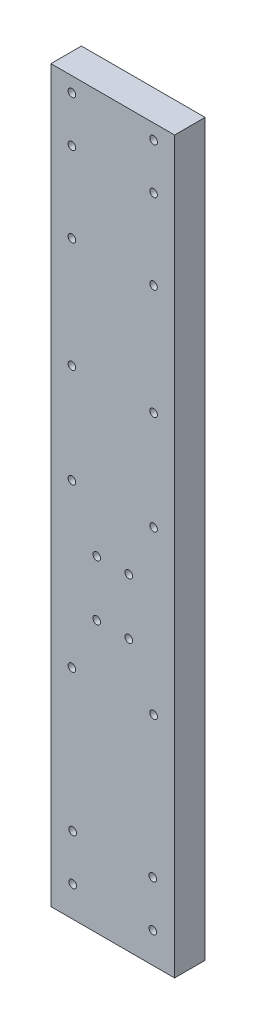
ISO-10303-21;
HEADER;
FILE_DESCRIPTION(('STEP AP214'),'2;1');
FILE_NAME('part.step','',(''),(''),'','','');
FILE_SCHEMA(('AUTOMOTIVE_DESIGN { 1 0 10303 214 1 1 1 1 }'));
ENDSEC;
DATA;
#1=APPLICATION_CONTEXT('core data for automotive mechanical design processes');
#2=APPLICATION_PROTOCOL_DEFINITION('international standard','automotive_design',2000,#1);
#3=PRODUCT_CONTEXT('',#1,'mechanical');
#4=PRODUCT('Part','Part','',(#3));
#5=PRODUCT_RELATED_PRODUCT_CATEGORY('part','',(#4));
#6=PRODUCT_DEFINITION_FORMATION('','',#4);
#7=PRODUCT_DEFINITION_CONTEXT('part definition',#1,'design');
#8=PRODUCT_DEFINITION('design','',#6,#7);
#9=PRODUCT_DEFINITION_SHAPE('','',#8);
#10=(LENGTH_UNIT() NAMED_UNIT(*) SI_UNIT(.MILLI.,.METRE.));
#11=(NAMED_UNIT(*) PLANE_ANGLE_UNIT() SI_UNIT($,.RADIAN.));
#12=(NAMED_UNIT(*) SI_UNIT($,.STERADIAN.) SOLID_ANGLE_UNIT());
#13=UNCERTAINTY_MEASURE_WITH_UNIT(LENGTH_MEASURE(1.E-05),#10,'distance_accuracy_value','');
#14=(GEOMETRIC_REPRESENTATION_CONTEXT(3) GLOBAL_UNCERTAINTY_ASSIGNED_CONTEXT((#13)) GLOBAL_UNIT_ASSIGNED_CONTEXT((#10,
#11,#12)) REPRESENTATION_CONTEXT('',''));
#15=CARTESIAN_POINT('',(0.,0.,0.));
#16=DIRECTION('',(0.,0.,1.));
#17=DIRECTION('',(1.,0.,0.));
#18=AXIS2_PLACEMENT_3D('',#15,#16,#17);
#19=CARTESIAN_POINT('',(0.,0.,4.));
#20=DIRECTION('',(0.,0.,-1.));
#21=DIRECTION('',(-1.,0.,0.));
#22=AXIS2_PLACEMENT_3D('',#19,#20,#21);
#23=PLANE('',#22);
#24=CARTESIAN_POINT('',(2.7500000000009,93.5614488310554,4.));
#25=DIRECTION('',(0.,0.,1.));
#26=DIRECTION('',(-1.,0.,0.));
#27=AXIS2_PLACEMENT_3D('',#24,#25,#26);
#28=CIRCLE('',#27,0.499999999999999);
#29=CARTESIAN_POINT('',(2.2500000000009,93.5614488310554,4.));
#30=VERTEX_POINT('',#29);
#31=EDGE_CURVE('E217',#30,#30,#28,.T.);
#32=ORIENTED_EDGE('',*,*,#31,.F.);
#33=EDGE_LOOP('',(#32));
#34=FACE_BOUND('',#33,.T.);
#35=CARTESIAN_POINT('',(13.4500000000022,87.5614488310554,4.));
#36=DIRECTION('',(0.,0.,1.));
#37=DIRECTION('',(1.,0.,0.));
#38=AXIS2_PLACEMENT_3D('',#35,#36,#37);
#39=CIRCLE('',#38,0.499999999999999);
#40=CARTESIAN_POINT('',(13.9500000000022,87.5614488310554,4.));
#41=VERTEX_POINT('',#40);
#42=EDGE_CURVE('E205',#41,#41,#39,.T.);
#43=ORIENTED_EDGE('',*,*,#42,.F.);
#44=EDGE_LOOP('',(#43));
#45=FACE_BOUND('',#44,.T.);
#46=CARTESIAN_POINT('',(13.4500000000001,77.0614488310554,4.));
#47=DIRECTION('',(0.,0.,1.));
#48=DIRECTION('',(1.,0.,0.));
#49=AXIS2_PLACEMENT_3D('',#46,#47,#48);
#50=CIRCLE('',#49,0.499999999999996);
#51=CARTESIAN_POINT('',(13.9500000000001,77.0614488310554,4.));
#52=VERTEX_POINT('',#51);
#53=EDGE_CURVE('E193',#52,#52,#50,.T.);
#54=ORIENTED_EDGE('',*,*,#53,.F.);
#55=EDGE_LOOP('',(#54));
#56=FACE_BOUND('',#55,.T.);
#57=CARTESIAN_POINT('',(13.350000000001,3.84644883105539,4.));
#58=DIRECTION('',(0.,0.,1.));
#59=DIRECTION('',(-1.,0.,0.));
#60=AXIS2_PLACEMENT_3D('',#57,#58,#59);
#61=CIRCLE('',#60,0.499999999999995);
#62=CARTESIAN_POINT('',(12.850000000001,3.84644883105539,4.));
#63=VERTEX_POINT('',#62);
#64=EDGE_CURVE('E181',#63,#63,#61,.T.);
#65=ORIENTED_EDGE('',*,*,#64,.F.);
#66=EDGE_LOOP('',(#65));
#67=FACE_BOUND('',#66,.T.);
#68=CARTESIAN_POINT('',(2.84999999999999,3.84644883105539,4.));
#69=DIRECTION('',(0.,0.,1.));
#70=DIRECTION('',(1.,0.,0.));
#71=AXIS2_PLACEMENT_3D('',#68,#69,#70);
#72=CIRCLE('',#71,0.499999999999999);
#73=CARTESIAN_POINT('',(3.34999999999999,3.84644883105539,4.));
#74=VERTEX_POINT('',#73);
#75=EDGE_CURVE('E169',#74,#74,#72,.T.);
#76=ORIENTED_EDGE('',*,*,#75,.F.);
#77=EDGE_LOOP('',(#76));
#78=FACE_BOUND('',#77,.T.);
#79=CARTESIAN_POINT('',(2.85,9.84644883105539,4.));
#80=DIRECTION('',(0.,0.,1.));
#81=DIRECTION('',(1.,0.,0.));
#82=AXIS2_PLACEMENT_3D('',#79,#80,#81);
#83=CIRCLE('',#82,0.499999999999999);
#84=CARTESIAN_POINT('',(3.35,9.84644883105539,4.));
#85=VERTEX_POINT('',#84);
#86=EDGE_CURVE('E157',#85,#85,#83,.T.);
#87=ORIENTED_EDGE('',*,*,#86,.F.);
#88=EDGE_LOOP('',(#87));
#89=FACE_BOUND('',#88,.T.);
#90=CARTESIAN_POINT('',(13.4500000000001,49.6064488310554,4.));
#91=DIRECTION('',(0.,0.,1.));
#92=DIRECTION('',(1.,0.,0.));
#93=AXIS2_PLACEMENT_3D('',#90,#91,#92);
#94=CIRCLE('',#93,0.499999999999999);
#95=CARTESIAN_POINT('',(13.9500000000001,49.6064488310554,4.));
#96=VERTEX_POINT('',#95);
#97=EDGE_CURVE('E145',#96,#96,#94,.T.);
#98=ORIENTED_EDGE('',*,*,#97,.F.);
#99=EDGE_LOOP('',(#98));
#100=FACE_BOUND('',#99,.T.);
#101=CARTESIAN_POINT('',(13.4500000000001,28.3464488310553,4.));
#102=DIRECTION('',(0.,0.,1.));
#103=DIRECTION('',(1.,0.,0.));
#104=AXIS2_PLACEMENT_3D('',#101,#102,#103);
#105=CIRCLE('',#104,0.499999999999999);
#106=CARTESIAN_POINT('',(13.9500000000001,28.3464488310553,4.));
#107=VERTEX_POINT('',#106);
#108=EDGE_CURVE('E133',#107,#107,#105,.T.);
#109=ORIENTED_EDGE('',*,*,#108,.F.);
#110=EDGE_LOOP('',(#109));
#111=FACE_BOUND('',#110,.T.);
#112=CARTESIAN_POINT('',(10.2000000000001,35.346448831055,4.));
#113=DIRECTION('',(0.,0.,1.));
#114=DIRECTION('',(1.,0.,0.));
#115=AXIS2_PLACEMENT_3D('',#112,#113,#114);
#116=CIRCLE('',#115,0.499999999999999);
#117=CARTESIAN_POINT('',(10.7000000000001,35.346448831055,4.));
#118=VERTEX_POINT('',#117);
#119=EDGE_CURVE('E121',#118,#118,#116,.T.);
#120=ORIENTED_EDGE('',*,*,#119,.F.);
#121=EDGE_LOOP('',(#120));
#122=FACE_BOUND('',#121,.T.);
#123=CARTESIAN_POINT('',(10.2000000000001,42.6664488310547,4.));
#124=DIRECTION('',(0.,0.,1.));
#125=DIRECTION('',(1.,0.,0.));
#126=AXIS2_PLACEMENT_3D('',#123,#124,#125);
#127=CIRCLE('',#126,0.499999999999999);
#128=CARTESIAN_POINT('',(10.7000000000001,42.6664488310547,4.));
#129=VERTEX_POINT('',#128);
#130=EDGE_CURVE('E100',#129,#129,#127,.T.);
#131=ORIENTED_EDGE('',*,*,#130,.F.);
#132=EDGE_LOOP('',(#131));
#133=FACE_BOUND('',#132,.T.);
#134=DIRECTION('',(1.,0.,0.));
#135=VECTOR('',#134,1.);
#136=CARTESIAN_POINT('',(0.,-0.15355116894461,4.));
#137=LINE('',#136,#135);
#138=CARTESIAN_POINT('',(0.,-0.15355116894461,4.));
#139=VERTEX_POINT('',#138);
#140=CARTESIAN_POINT('',(16.2,-0.15355116894461,4.));
#141=VERTEX_POINT('',#140);
#142=EDGE_CURVE('E85',#139,#141,#137,.T.);
#143=ORIENTED_EDGE('',*,*,#142,.T.);
#144=DIRECTION('',(0.,1.,0.));
#145=VECTOR('',#144,1.);
#146=CARTESIAN_POINT('',(16.2,95.5064488310554,4.));
#147=LINE('',#146,#145);
#148=CARTESIAN_POINT('',(16.2,95.5064488310554,4.));
#149=VERTEX_POINT('',#148);
#150=EDGE_CURVE('E80',#141,#149,#147,.T.);
#151=ORIENTED_EDGE('',*,*,#150,.T.);
#152=DIRECTION('',(-1.,0.,0.));
#153=VECTOR('',#152,1.);
#154=CARTESIAN_POINT('',(0.,95.5064488310554,4.));
#155=LINE('',#154,#153);
#156=CARTESIAN_POINT('',(0.,95.5064488310554,4.));
#157=VERTEX_POINT('',#156);
#158=EDGE_CURVE('E83',#149,#157,#155,.T.);
#159=ORIENTED_EDGE('',*,*,#158,.T.);
#160=DIRECTION('',(0.,-1.,0.));
#161=VECTOR('',#160,1.);
#162=CARTESIAN_POINT('',(0.,95.5064488310554,4.));
#163=LINE('',#162,#161);
#164=EDGE_CURVE('E50',#157,#139,#163,.T.);
#165=ORIENTED_EDGE('',*,*,#164,.T.);
#166=EDGE_LOOP('',(#143,#151,#159,#165));
#167=FACE_BOUND('',#166,.T.);
#168=CARTESIAN_POINT('',(6.,42.6064488310554,4.));
#169=DIRECTION('',(0.,0.,1.));
#170=DIRECTION('',(1.,0.,0.));
#171=AXIS2_PLACEMENT_3D('',#168,#169,#170);
#172=CIRCLE('',#171,0.500000000000002);
#173=CARTESIAN_POINT('',(6.5,42.6064488310554,4.));
#174=VERTEX_POINT('',#173);
#175=EDGE_CURVE('E115',#174,#174,#172,.T.);
#176=ORIENTED_EDGE('',*,*,#175,.F.);
#177=EDGE_LOOP('',(#176));
#178=FACE_BOUND('',#177,.T.);
#179=CARTESIAN_POINT('',(6.,35.346448831055,4.));
#180=DIRECTION('',(0.,0.,1.));
#181=DIRECTION('',(1.,0.,0.));
#182=AXIS2_PLACEMENT_3D('',#179,#180,#181);
#183=CIRCLE('',#182,0.499999999999999);
#184=CARTESIAN_POINT('',(6.5,35.346448831055,4.));
#185=VERTEX_POINT('',#184);
#186=EDGE_CURVE('E127',#185,#185,#183,.T.);
#187=ORIENTED_EDGE('',*,*,#186,.F.);
#188=EDGE_LOOP('',(#187));
#189=FACE_BOUND('',#188,.T.);
#190=CARTESIAN_POINT('',(2.75000000000003,28.3464488310555,4.));
#191=DIRECTION('',(0.,0.,1.));
#192=DIRECTION('',(1.,0.,0.));
#193=AXIS2_PLACEMENT_3D('',#190,#191,#192);
#194=CIRCLE('',#193,0.499999999999999);
#195=CARTESIAN_POINT('',(3.25000000000003,28.3464488310555,4.));
#196=VERTEX_POINT('',#195);
#197=EDGE_CURVE('E139',#196,#196,#194,.T.);
#198=ORIENTED_EDGE('',*,*,#197,.F.);
#199=EDGE_LOOP('',(#198));
#200=FACE_BOUND('',#199,.T.);
#201=CARTESIAN_POINT('',(2.75000000000002,49.6064488310554,4.));
#202=DIRECTION('',(0.,0.,1.));
#203=DIRECTION('',(1.,0.,0.));
#204=AXIS2_PLACEMENT_3D('',#201,#202,#203);
#205=CIRCLE('',#204,0.499999999999999);
#206=CARTESIAN_POINT('',(3.25000000000002,49.6064488310554,4.));
#207=VERTEX_POINT('',#206);
#208=EDGE_CURVE('E151',#207,#207,#205,.T.);
#209=ORIENTED_EDGE('',*,*,#208,.F.);
#210=EDGE_LOOP('',(#209));
#211=FACE_BOUND('',#210,.T.);
#212=CARTESIAN_POINT('',(13.4500000000016,62.6064488310554,4.));
#213=DIRECTION('',(0.,0.,1.));
#214=DIRECTION('',(1.,0.,0.));
#215=AXIS2_PLACEMENT_3D('',#212,#213,#214);
#216=CIRCLE('',#215,0.499999999999996);
#217=CARTESIAN_POINT('',(13.9500000000016,62.6064488310554,4.));
#218=VERTEX_POINT('',#217);
#219=EDGE_CURVE('E163',#218,#218,#216,.T.);
#220=ORIENTED_EDGE('',*,*,#219,.F.);
#221=EDGE_LOOP('',(#220));
#222=FACE_BOUND('',#221,.T.);
#223=CARTESIAN_POINT('',(13.350000000001,9.8464488310554,4.));
#224=DIRECTION('',(0.,0.,1.));
#225=DIRECTION('',(-1.,0.,0.));
#226=AXIS2_PLACEMENT_3D('',#223,#224,#225);
#227=CIRCLE('',#226,0.499999999999999);
#228=CARTESIAN_POINT('',(12.850000000001,9.8464488310554,4.));
#229=VERTEX_POINT('',#228);
#230=EDGE_CURVE('E175',#229,#229,#227,.T.);
#231=ORIENTED_EDGE('',*,*,#230,.F.);
#232=EDGE_LOOP('',(#231));
#233=FACE_BOUND('',#232,.T.);
#234=CARTESIAN_POINT('',(2.75000000000136,62.6064488310554,4.));
#235=DIRECTION('',(0.,0.,1.));
#236=DIRECTION('',(1.,0.,0.));
#237=AXIS2_PLACEMENT_3D('',#234,#235,#236);
#238=CIRCLE('',#237,0.499999999999999);
#239=CARTESIAN_POINT('',(3.25000000000136,62.6064488310554,4.));
#240=VERTEX_POINT('',#239);
#241=EDGE_CURVE('E187',#240,#240,#238,.T.);
#242=ORIENTED_EDGE('',*,*,#241,.F.);
#243=EDGE_LOOP('',(#242));
#244=FACE_BOUND('',#243,.T.);
#245=CARTESIAN_POINT('',(2.75000000000002,77.0614488310554,4.));
#246=DIRECTION('',(0.,0.,1.));
#247=DIRECTION('',(1.,0.,0.));
#248=AXIS2_PLACEMENT_3D('',#245,#246,#247);
#249=CIRCLE('',#248,0.499999999999999);
#250=CARTESIAN_POINT('',(3.25000000000002,77.0614488310554,4.));
#251=VERTEX_POINT('',#250);
#252=EDGE_CURVE('E199',#251,#251,#249,.T.);
#253=ORIENTED_EDGE('',*,*,#252,.F.);
#254=EDGE_LOOP('',(#253));
#255=FACE_BOUND('',#254,.T.);
#256=CARTESIAN_POINT('',(2.7500000000009,87.5614488310554,4.));
#257=DIRECTION('',(0.,0.,1.));
#258=DIRECTION('',(1.,0.,0.));
#259=AXIS2_PLACEMENT_3D('',#256,#257,#258);
#260=CIRCLE('',#259,0.499999999999999);
#261=CARTESIAN_POINT('',(3.2500000000009,87.5614488310554,4.));
#262=VERTEX_POINT('',#261);
#263=EDGE_CURVE('E211',#262,#262,#260,.T.);
#264=ORIENTED_EDGE('',*,*,#263,.F.);
#265=EDGE_LOOP('',(#264));
#266=FACE_BOUND('',#265,.T.);
#267=CARTESIAN_POINT('',(13.4500000000022,93.5614488310554,4.));
#268=DIRECTION('',(0.,0.,1.));
#269=DIRECTION('',(-1.,0.,0.));
#270=AXIS2_PLACEMENT_3D('',#267,#268,#269);
#271=CIRCLE('',#270,0.499999999999996);
#272=CARTESIAN_POINT('',(12.9500000000022,93.5614488310554,4.));
#273=VERTEX_POINT('',#272);
#274=EDGE_CURVE('E223',#273,#273,#271,.T.);
#275=ORIENTED_EDGE('',*,*,#274,.F.);
#276=EDGE_LOOP('',(#275));
#277=FACE_BOUND('',#276,.T.);
#278=ADVANCED_FACE('F33',(#34,#45,#56,#67,#78,#89,#100,#111,#122,#133,#167,#178,#189,#200,#211,
#222,#233,#244,#255,#266,#277),#23,.F.);
#279=CARTESIAN_POINT('',(0.,0.,0.));
#280=DIRECTION('',(0.,0.,-1.));
#281=DIRECTION('',(-1.,0.,0.));
#282=AXIS2_PLACEMENT_3D('',#279,#280,#281);
#283=PLANE('',#282);
#284=CARTESIAN_POINT('',(2.7500000000009,93.5614488310554,0.));
#285=DIRECTION('',(0.,0.,1.));
#286=DIRECTION('',(-1.,0.,0.));
#287=AXIS2_PLACEMENT_3D('',#284,#285,#286);
#288=CIRCLE('',#287,0.499999999999999);
#289=CARTESIAN_POINT('',(2.2500000000009,93.5614488310554,0.));
#290=VERTEX_POINT('',#289);
#291=EDGE_CURVE('E220',#290,#290,#288,.T.);
#292=ORIENTED_EDGE('',*,*,#291,.T.);
#293=EDGE_LOOP('',(#292));
#294=FACE_BOUND('',#293,.T.);
#295=CARTESIAN_POINT('',(13.4500000000022,87.5614488310554,0.));
#296=DIRECTION('',(0.,0.,1.));
#297=DIRECTION('',(1.,0.,0.));
#298=AXIS2_PLACEMENT_3D('',#295,#296,#297);
#299=CIRCLE('',#298,0.499999999999999);
#300=CARTESIAN_POINT('',(13.9500000000022,87.5614488310554,0.));
#301=VERTEX_POINT('',#300);
#302=EDGE_CURVE('E208',#301,#301,#299,.T.);
#303=ORIENTED_EDGE('',*,*,#302,.T.);
#304=EDGE_LOOP('',(#303));
#305=FACE_BOUND('',#304,.T.);
#306=CARTESIAN_POINT('',(13.4500000000001,77.0614488310554,0.));
#307=DIRECTION('',(0.,0.,1.));
#308=DIRECTION('',(1.,0.,0.));
#309=AXIS2_PLACEMENT_3D('',#306,#307,#308);
#310=CIRCLE('',#309,0.499999999999996);
#311=CARTESIAN_POINT('',(13.9500000000001,77.0614488310554,0.));
#312=VERTEX_POINT('',#311);
#313=EDGE_CURVE('E196',#312,#312,#310,.T.);
#314=ORIENTED_EDGE('',*,*,#313,.T.);
#315=EDGE_LOOP('',(#314));
#316=FACE_BOUND('',#315,.T.);
#317=CARTESIAN_POINT('',(13.350000000001,3.84644883105539,0.));
#318=DIRECTION('',(0.,0.,1.));
#319=DIRECTION('',(-1.,0.,0.));
#320=AXIS2_PLACEMENT_3D('',#317,#318,#319);
#321=CIRCLE('',#320,0.499999999999995);
#322=CARTESIAN_POINT('',(12.850000000001,3.84644883105539,0.));
#323=VERTEX_POINT('',#322);
#324=EDGE_CURVE('E184',#323,#323,#321,.T.);
#325=ORIENTED_EDGE('',*,*,#324,.T.);
#326=EDGE_LOOP('',(#325));
#327=FACE_BOUND('',#326,.T.);
#328=CARTESIAN_POINT('',(2.84999999999999,3.84644883105539,0.));
#329=DIRECTION('',(0.,0.,1.));
#330=DIRECTION('',(1.,0.,0.));
#331=AXIS2_PLACEMENT_3D('',#328,#329,#330);
#332=CIRCLE('',#331,0.499999999999999);
#333=CARTESIAN_POINT('',(3.34999999999999,3.84644883105539,0.));
#334=VERTEX_POINT('',#333);
#335=EDGE_CURVE('E172',#334,#334,#332,.T.);
#336=ORIENTED_EDGE('',*,*,#335,.T.);
#337=EDGE_LOOP('',(#336));
#338=FACE_BOUND('',#337,.T.);
#339=CARTESIAN_POINT('',(2.85,9.84644883105539,0.));
#340=DIRECTION('',(0.,0.,1.));
#341=DIRECTION('',(1.,0.,0.));
#342=AXIS2_PLACEMENT_3D('',#339,#340,#341);
#343=CIRCLE('',#342,0.499999999999999);
#344=CARTESIAN_POINT('',(3.35,9.84644883105539,0.));
#345=VERTEX_POINT('',#344);
#346=EDGE_CURVE('E160',#345,#345,#343,.T.);
#347=ORIENTED_EDGE('',*,*,#346,.T.);
#348=EDGE_LOOP('',(#347));
#349=FACE_BOUND('',#348,.T.);
#350=CARTESIAN_POINT('',(13.4500000000001,49.6064488310554,0.));
#351=DIRECTION('',(0.,0.,1.));
#352=DIRECTION('',(1.,0.,0.));
#353=AXIS2_PLACEMENT_3D('',#350,#351,#352);
#354=CIRCLE('',#353,0.499999999999999);
#355=CARTESIAN_POINT('',(13.9500000000001,49.6064488310554,0.));
#356=VERTEX_POINT('',#355);
#357=EDGE_CURVE('E148',#356,#356,#354,.T.);
#358=ORIENTED_EDGE('',*,*,#357,.T.);
#359=EDGE_LOOP('',(#358));
#360=FACE_BOUND('',#359,.T.);
#361=CARTESIAN_POINT('',(13.4500000000001,28.3464488310553,0.));
#362=DIRECTION('',(0.,0.,1.));
#363=DIRECTION('',(1.,0.,0.));
#364=AXIS2_PLACEMENT_3D('',#361,#362,#363);
#365=CIRCLE('',#364,0.499999999999999);
#366=CARTESIAN_POINT('',(13.9500000000001,28.3464488310553,0.));
#367=VERTEX_POINT('',#366);
#368=EDGE_CURVE('E136',#367,#367,#365,.T.);
#369=ORIENTED_EDGE('',*,*,#368,.T.);
#370=EDGE_LOOP('',(#369));
#371=FACE_BOUND('',#370,.T.);
#372=CARTESIAN_POINT('',(10.2000000000001,35.346448831055,0.));
#373=DIRECTION('',(0.,0.,1.));
#374=DIRECTION('',(1.,0.,0.));
#375=AXIS2_PLACEMENT_3D('',#372,#373,#374);
#376=CIRCLE('',#375,0.499999999999999);
#377=CARTESIAN_POINT('',(10.7000000000001,35.346448831055,0.));
#378=VERTEX_POINT('',#377);
#379=EDGE_CURVE('E124',#378,#378,#376,.T.);
#380=ORIENTED_EDGE('',*,*,#379,.T.);
#381=EDGE_LOOP('',(#380));
#382=FACE_BOUND('',#381,.T.);
#383=CARTESIAN_POINT('',(10.2000000000001,42.6664488310547,0.));
#384=DIRECTION('',(0.,0.,1.));
#385=DIRECTION('',(1.,0.,0.));
#386=AXIS2_PLACEMENT_3D('',#383,#384,#385);
#387=CIRCLE('',#386,0.499999999999999);
#388=CARTESIAN_POINT('',(10.7000000000001,42.6664488310547,0.));
#389=VERTEX_POINT('',#388);
#390=EDGE_CURVE('E112',#389,#389,#387,.T.);
#391=ORIENTED_EDGE('',*,*,#390,.T.);
#392=EDGE_LOOP('',(#391));
#393=FACE_BOUND('',#392,.T.);
#394=DIRECTION('',(1.,0.,0.));
#395=VECTOR('',#394,1.);
#396=CARTESIAN_POINT('',(0.,-0.15355116894461,0.));
#397=LINE('',#396,#395);
#398=CARTESIAN_POINT('',(0.,-0.15355116894461,0.));
#399=VERTEX_POINT('',#398);
#400=CARTESIAN_POINT('',(16.2,-0.15355116894461,0.));
#401=VERTEX_POINT('',#400);
#402=EDGE_CURVE('E97',#399,#401,#397,.T.);
#403=ORIENTED_EDGE('',*,*,#402,.F.);
#404=DIRECTION('',(0.,-1.,0.));
#405=VECTOR('',#404,1.);
#406=CARTESIAN_POINT('',(0.,95.5064488310554,0.));
#407=LINE('',#406,#405);
#408=CARTESIAN_POINT('',(0.,95.5064488310554,0.));
#409=VERTEX_POINT('',#408);
#410=EDGE_CURVE('E73',#409,#399,#407,.T.);
#411=ORIENTED_EDGE('',*,*,#410,.F.);
#412=DIRECTION('',(-1.,0.,0.));
#413=VECTOR('',#412,1.);
#414=CARTESIAN_POINT('',(0.,95.5064488310554,0.));
#415=LINE('',#414,#413);
#416=CARTESIAN_POINT('',(16.2,95.5064488310554,0.));
#417=VERTEX_POINT('',#416);
#418=EDGE_CURVE('E67',#417,#409,#415,.T.);
#419=ORIENTED_EDGE('',*,*,#418,.F.);
#420=DIRECTION('',(0.,1.,0.));
#421=VECTOR('',#420,1.);
#422=CARTESIAN_POINT('',(16.2,95.5064488310554,0.));
#423=LINE('',#422,#421);
#424=EDGE_CURVE('E89',#401,#417,#423,.T.);
#425=ORIENTED_EDGE('',*,*,#424,.F.);
#426=EDGE_LOOP('',(#403,#411,#419,#425));
#427=FACE_BOUND('',#426,.T.);
#428=CARTESIAN_POINT('',(6.,42.6064488310554,0.));
#429=DIRECTION('',(0.,0.,1.));
#430=DIRECTION('',(1.,0.,0.));
#431=AXIS2_PLACEMENT_3D('',#428,#429,#430);
#432=CIRCLE('',#431,0.500000000000002);
#433=CARTESIAN_POINT('',(6.5,42.6064488310554,0.));
#434=VERTEX_POINT('',#433);
#435=EDGE_CURVE('E118',#434,#434,#432,.T.);
#436=ORIENTED_EDGE('',*,*,#435,.T.);
#437=EDGE_LOOP('',(#436));
#438=FACE_BOUND('',#437,.T.);
#439=CARTESIAN_POINT('',(6.,35.346448831055,0.));
#440=DIRECTION('',(0.,0.,1.));
#441=DIRECTION('',(1.,0.,0.));
#442=AXIS2_PLACEMENT_3D('',#439,#440,#441);
#443=CIRCLE('',#442,0.499999999999999);
#444=CARTESIAN_POINT('',(6.5,35.346448831055,0.));
#445=VERTEX_POINT('',#444);
#446=EDGE_CURVE('E130',#445,#445,#443,.T.);
#447=ORIENTED_EDGE('',*,*,#446,.T.);
#448=EDGE_LOOP('',(#447));
#449=FACE_BOUND('',#448,.T.);
#450=CARTESIAN_POINT('',(2.75000000000003,28.3464488310555,0.));
#451=DIRECTION('',(0.,0.,1.));
#452=DIRECTION('',(1.,0.,0.));
#453=AXIS2_PLACEMENT_3D('',#450,#451,#452);
#454=CIRCLE('',#453,0.499999999999999);
#455=CARTESIAN_POINT('',(3.25000000000003,28.3464488310555,0.));
#456=VERTEX_POINT('',#455);
#457=EDGE_CURVE('E142',#456,#456,#454,.T.);
#458=ORIENTED_EDGE('',*,*,#457,.T.);
#459=EDGE_LOOP('',(#458));
#460=FACE_BOUND('',#459,.T.);
#461=CARTESIAN_POINT('',(2.75000000000002,49.6064488310554,0.));
#462=DIRECTION('',(0.,0.,1.));
#463=DIRECTION('',(1.,0.,0.));
#464=AXIS2_PLACEMENT_3D('',#461,#462,#463);
#465=CIRCLE('',#464,0.499999999999999);
#466=CARTESIAN_POINT('',(3.25000000000002,49.6064488310554,0.));
#467=VERTEX_POINT('',#466);
#468=EDGE_CURVE('E154',#467,#467,#465,.T.);
#469=ORIENTED_EDGE('',*,*,#468,.T.);
#470=EDGE_LOOP('',(#469));
#471=FACE_BOUND('',#470,.T.);
#472=CARTESIAN_POINT('',(13.4500000000016,62.6064488310554,0.));
#473=DIRECTION('',(0.,0.,1.));
#474=DIRECTION('',(1.,0.,0.));
#475=AXIS2_PLACEMENT_3D('',#472,#473,#474);
#476=CIRCLE('',#475,0.499999999999996);
#477=CARTESIAN_POINT('',(13.9500000000016,62.6064488310554,0.));
#478=VERTEX_POINT('',#477);
#479=EDGE_CURVE('E166',#478,#478,#476,.T.);
#480=ORIENTED_EDGE('',*,*,#479,.T.);
#481=EDGE_LOOP('',(#480));
#482=FACE_BOUND('',#481,.T.);
#483=CARTESIAN_POINT('',(13.350000000001,9.8464488310554,0.));
#484=DIRECTION('',(0.,0.,1.));
#485=DIRECTION('',(-1.,0.,0.));
#486=AXIS2_PLACEMENT_3D('',#483,#484,#485);
#487=CIRCLE('',#486,0.499999999999999);
#488=CARTESIAN_POINT('',(12.850000000001,9.8464488310554,0.));
#489=VERTEX_POINT('',#488);
#490=EDGE_CURVE('E178',#489,#489,#487,.T.);
#491=ORIENTED_EDGE('',*,*,#490,.T.);
#492=EDGE_LOOP('',(#491));
#493=FACE_BOUND('',#492,.T.);
#494=CARTESIAN_POINT('',(2.75000000000136,62.6064488310554,0.));
#495=DIRECTION('',(0.,0.,1.));
#496=DIRECTION('',(1.,0.,0.));
#497=AXIS2_PLACEMENT_3D('',#494,#495,#496);
#498=CIRCLE('',#497,0.499999999999999);
#499=CARTESIAN_POINT('',(3.25000000000136,62.6064488310554,0.));
#500=VERTEX_POINT('',#499);
#501=EDGE_CURVE('E190',#500,#500,#498,.T.);
#502=ORIENTED_EDGE('',*,*,#501,.T.);
#503=EDGE_LOOP('',(#502));
#504=FACE_BOUND('',#503,.T.);
#505=CARTESIAN_POINT('',(2.75000000000002,77.0614488310554,0.));
#506=DIRECTION('',(0.,0.,1.));
#507=DIRECTION('',(1.,0.,0.));
#508=AXIS2_PLACEMENT_3D('',#505,#506,#507);
#509=CIRCLE('',#508,0.499999999999999);
#510=CARTESIAN_POINT('',(3.25000000000002,77.0614488310554,0.));
#511=VERTEX_POINT('',#510);
#512=EDGE_CURVE('E202',#511,#511,#509,.T.);
#513=ORIENTED_EDGE('',*,*,#512,.T.);
#514=EDGE_LOOP('',(#513));
#515=FACE_BOUND('',#514,.T.);
#516=CARTESIAN_POINT('',(2.7500000000009,87.5614488310554,0.));
#517=DIRECTION('',(0.,0.,1.));
#518=DIRECTION('',(1.,0.,0.));
#519=AXIS2_PLACEMENT_3D('',#516,#517,#518);
#520=CIRCLE('',#519,0.499999999999999);
#521=CARTESIAN_POINT('',(3.2500000000009,87.5614488310554,0.));
#522=VERTEX_POINT('',#521);
#523=EDGE_CURVE('E214',#522,#522,#520,.T.);
#524=ORIENTED_EDGE('',*,*,#523,.T.);
#525=EDGE_LOOP('',(#524));
#526=FACE_BOUND('',#525,.T.);
#527=CARTESIAN_POINT('',(13.4500000000022,93.5614488310554,0.));
#528=DIRECTION('',(0.,0.,1.));
#529=DIRECTION('',(-1.,0.,0.));
#530=AXIS2_PLACEMENT_3D('',#527,#528,#529);
#531=CIRCLE('',#530,0.499999999999996);
#532=CARTESIAN_POINT('',(12.9500000000022,93.5614488310554,0.));
#533=VERTEX_POINT('',#532);
#534=EDGE_CURVE('E226',#533,#533,#531,.T.);
#535=ORIENTED_EDGE('',*,*,#534,.T.);
#536=EDGE_LOOP('',(#535));
#537=FACE_BOUND('',#536,.T.);
#538=ADVANCED_FACE('F108',(#294,#305,#316,#327,#338,#349,#360,#371,#382,#393,#427,#438,#449,
#460,#471,#482,#493,#504,#515,#526,#537),#283,.T.);
#539=CARTESIAN_POINT('',(0.,-0.15355116894461,4.));
#540=DIRECTION('',(0.,1.,0.));
#541=DIRECTION('',(0.,0.,1.));
#542=AXIS2_PLACEMENT_3D('',#539,#540,#541);
#543=PLANE('',#542);
#544=ORIENTED_EDGE('',*,*,#402,.T.);
#545=DIRECTION('',(0.,0.,-1.));
#546=VECTOR('',#545,1.);
#547=CARTESIAN_POINT('',(16.2,-0.15355116894461,4.));
#548=LINE('',#547,#546);
#549=EDGE_CURVE('E11',#141,#401,#548,.T.);
#550=ORIENTED_EDGE('',*,*,#549,.F.);
#551=ORIENTED_EDGE('',*,*,#142,.F.);
#552=DIRECTION('',(0.,0.,-1.));
#553=VECTOR('',#552,1.);
#554=CARTESIAN_POINT('',(0.,-0.15355116894461,4.));
#555=LINE('',#554,#553);
#556=EDGE_CURVE('E93',#139,#399,#555,.T.);
#557=ORIENTED_EDGE('',*,*,#556,.T.);
#558=EDGE_LOOP('',(#544,#550,#551,#557));
#559=FACE_BOUND('',#558,.T.);
#560=ADVANCED_FACE('F35',(#559),#543,.F.);
#561=CARTESIAN_POINT('',(16.2,95.5064488310554,4.));
#562=DIRECTION('',(-1.,0.,0.));
#563=DIRECTION('',(0.,-1.,0.));
#564=AXIS2_PLACEMENT_3D('',#561,#562,#563);
#565=PLANE('',#564);
#566=ORIENTED_EDGE('',*,*,#424,.T.);
#567=DIRECTION('',(0.,0.,-1.));
#568=VECTOR('',#567,1.);
#569=CARTESIAN_POINT('',(16.2,95.5064488310554,4.));
#570=LINE('',#569,#568);
#571=EDGE_CURVE('E42',#149,#417,#570,.T.);
#572=ORIENTED_EDGE('',*,*,#571,.F.);
#573=ORIENTED_EDGE('',*,*,#150,.F.);
#574=ORIENTED_EDGE('',*,*,#549,.T.);
#575=EDGE_LOOP('',(#566,#572,#573,#574));
#576=FACE_BOUND('',#575,.T.);
#577=ADVANCED_FACE('F88',(#576),#565,.F.);
#578=CARTESIAN_POINT('',(0.,95.5064488310554,4.));
#579=DIRECTION('',(0.,-1.,0.));
#580=DIRECTION('',(0.,0.,-1.));
#581=AXIS2_PLACEMENT_3D('',#578,#579,#580);
#582=PLANE('',#581);
#583=ORIENTED_EDGE('',*,*,#418,.T.);
#584=DIRECTION('',(0.,0.,-1.));
#585=VECTOR('',#584,1.);
#586=CARTESIAN_POINT('',(0.,95.5064488310554,4.));
#587=LINE('',#586,#585);
#588=EDGE_CURVE('E90',#157,#409,#587,.T.);
#589=ORIENTED_EDGE('',*,*,#588,.F.);
#590=ORIENTED_EDGE('',*,*,#158,.F.);
#591=ORIENTED_EDGE('',*,*,#571,.T.);
#592=EDGE_LOOP('',(#583,#589,#590,#591));
#593=FACE_BOUND('',#592,.T.);
#594=ADVANCED_FACE('F91',(#593),#582,.F.);
#595=CARTESIAN_POINT('',(0.,95.5064488310554,4.));
#596=DIRECTION('',(1.,0.,0.));
#597=DIRECTION('',(0.,1.,0.));
#598=AXIS2_PLACEMENT_3D('',#595,#596,#597);
#599=PLANE('',#598);
#600=ORIENTED_EDGE('',*,*,#410,.T.);
#601=ORIENTED_EDGE('',*,*,#556,.F.);
#602=ORIENTED_EDGE('',*,*,#164,.F.);
#603=ORIENTED_EDGE('',*,*,#588,.T.);
#604=EDGE_LOOP('',(#600,#601,#602,#603));
#605=FACE_BOUND('',#604,.T.);
#606=ADVANCED_FACE('F105',(#605),#599,.F.);
#607=CARTESIAN_POINT('',(10.2000000000001,42.6664488310547,4.));
#608=DIRECTION('',(0.,0.,-1.));
#609=DIRECTION('',(-1.,0.,0.));
#610=AXIS2_PLACEMENT_3D('',#607,#608,#609);
#611=CYLINDRICAL_SURFACE('',#610,0.499999999999999);
#612=ORIENTED_EDGE('',*,*,#130,.T.);
#613=EDGE_LOOP('',(#612));
#614=FACE_BOUND('',#613,.T.);
#615=ORIENTED_EDGE('',*,*,#390,.F.);
#616=EDGE_LOOP('',(#615));
#617=FACE_BOUND('',#616,.T.);
#618=ADVANCED_FACE('F246',(#614,#617),#611,.F.);
#619=CARTESIAN_POINT('',(6.,42.6064488310554,4.));
#620=DIRECTION('',(0.,0.,-1.));
#621=DIRECTION('',(-1.,0.,0.));
#622=AXIS2_PLACEMENT_3D('',#619,#620,#621);
#623=CYLINDRICAL_SURFACE('',#622,0.500000000000002);
#624=ORIENTED_EDGE('',*,*,#175,.T.);
#625=EDGE_LOOP('',(#624));
#626=FACE_BOUND('',#625,.T.);
#627=ORIENTED_EDGE('',*,*,#435,.F.);
#628=EDGE_LOOP('',(#627));
#629=FACE_BOUND('',#628,.T.);
#630=ADVANCED_FACE('F292',(#626,#629),#623,.F.);
#631=CARTESIAN_POINT('',(10.2000000000001,35.346448831055,4.));
#632=DIRECTION('',(0.,0.,-1.));
#633=DIRECTION('',(-1.,0.,0.));
#634=AXIS2_PLACEMENT_3D('',#631,#632,#633);
#635=CYLINDRICAL_SURFACE('',#634,0.499999999999999);
#636=ORIENTED_EDGE('',*,*,#119,.T.);
#637=EDGE_LOOP('',(#636));
#638=FACE_BOUND('',#637,.T.);
#639=ORIENTED_EDGE('',*,*,#379,.F.);
#640=EDGE_LOOP('',(#639));
#641=FACE_BOUND('',#640,.T.);
#642=ADVANCED_FACE('F300',(#638,#641),#635,.F.);
#643=CARTESIAN_POINT('',(6.,35.346448831055,4.));
#644=DIRECTION('',(0.,0.,-1.));
#645=DIRECTION('',(-1.,0.,0.));
#646=AXIS2_PLACEMENT_3D('',#643,#644,#645);
#647=CYLINDRICAL_SURFACE('',#646,0.499999999999999);
#648=ORIENTED_EDGE('',*,*,#186,.T.);
#649=EDGE_LOOP('',(#648));
#650=FACE_BOUND('',#649,.T.);
#651=ORIENTED_EDGE('',*,*,#446,.F.);
#652=EDGE_LOOP('',(#651));
#653=FACE_BOUND('',#652,.T.);
#654=ADVANCED_FACE('F308',(#650,#653),#647,.F.);
#655=CARTESIAN_POINT('',(13.4500000000001,28.3464488310553,4.));
#656=DIRECTION('',(0.,0.,-1.));
#657=DIRECTION('',(-1.,0.,0.));
#658=AXIS2_PLACEMENT_3D('',#655,#656,#657);
#659=CYLINDRICAL_SURFACE('',#658,0.499999999999999);
#660=ORIENTED_EDGE('',*,*,#108,.T.);
#661=EDGE_LOOP('',(#660));
#662=FACE_BOUND('',#661,.T.);
#663=ORIENTED_EDGE('',*,*,#368,.F.);
#664=EDGE_LOOP('',(#663));
#665=FACE_BOUND('',#664,.T.);
#666=ADVANCED_FACE('F317',(#662,#665),#659,.F.);
#667=CARTESIAN_POINT('',(2.75000000000003,28.3464488310555,4.));
#668=DIRECTION('',(0.,0.,-1.));
#669=DIRECTION('',(-1.,0.,0.));
#670=AXIS2_PLACEMENT_3D('',#667,#668,#669);
#671=CYLINDRICAL_SURFACE('',#670,0.499999999999999);
#672=ORIENTED_EDGE('',*,*,#197,.T.);
#673=EDGE_LOOP('',(#672));
#674=FACE_BOUND('',#673,.T.);
#675=ORIENTED_EDGE('',*,*,#457,.F.);
#676=EDGE_LOOP('',(#675));
#677=FACE_BOUND('',#676,.T.);
#678=ADVANCED_FACE('F326',(#674,#677),#671,.F.);
#679=CARTESIAN_POINT('',(13.4500000000001,49.6064488310554,4.));
#680=DIRECTION('',(0.,0.,-1.));
#681=DIRECTION('',(-1.,0.,0.));
#682=AXIS2_PLACEMENT_3D('',#679,#680,#681);
#683=CYLINDRICAL_SURFACE('',#682,0.499999999999999);
#684=ORIENTED_EDGE('',*,*,#97,.T.);
#685=EDGE_LOOP('',(#684));
#686=FACE_BOUND('',#685,.T.);
#687=ORIENTED_EDGE('',*,*,#357,.F.);
#688=EDGE_LOOP('',(#687));
#689=FACE_BOUND('',#688,.T.);
#690=ADVANCED_FACE('F335',(#686,#689),#683,.F.);
#691=CARTESIAN_POINT('',(2.75000000000002,49.6064488310554,4.));
#692=DIRECTION('',(0.,0.,-1.));
#693=DIRECTION('',(-1.,0.,0.));
#694=AXIS2_PLACEMENT_3D('',#691,#692,#693);
#695=CYLINDRICAL_SURFACE('',#694,0.499999999999999);
#696=ORIENTED_EDGE('',*,*,#208,.T.);
#697=EDGE_LOOP('',(#696));
#698=FACE_BOUND('',#697,.T.);
#699=ORIENTED_EDGE('',*,*,#468,.F.);
#700=EDGE_LOOP('',(#699));
#701=FACE_BOUND('',#700,.T.);
#702=ADVANCED_FACE('F344',(#698,#701),#695,.F.);
#703=CARTESIAN_POINT('',(2.85,9.84644883105539,4.));
#704=DIRECTION('',(0.,0.,-1.));
#705=DIRECTION('',(-1.,0.,0.));
#706=AXIS2_PLACEMENT_3D('',#703,#704,#705);
#707=CYLINDRICAL_SURFACE('',#706,0.499999999999999);
#708=ORIENTED_EDGE('',*,*,#86,.T.);
#709=EDGE_LOOP('',(#708));
#710=FACE_BOUND('',#709,.T.);
#711=ORIENTED_EDGE('',*,*,#346,.F.);
#712=EDGE_LOOP('',(#711));
#713=FACE_BOUND('',#712,.T.);
#714=ADVANCED_FACE('F353',(#710,#713),#707,.F.);
#715=CARTESIAN_POINT('',(13.4500000000016,62.6064488310554,4.));
#716=DIRECTION('',(0.,0.,-1.));
#717=DIRECTION('',(-1.,0.,0.));
#718=AXIS2_PLACEMENT_3D('',#715,#716,#717);
#719=CYLINDRICAL_SURFACE('',#718,0.499999999999996);
#720=ORIENTED_EDGE('',*,*,#219,.T.);
#721=EDGE_LOOP('',(#720));
#722=FACE_BOUND('',#721,.T.);
#723=ORIENTED_EDGE('',*,*,#479,.F.);
#724=EDGE_LOOP('',(#723));
#725=FACE_BOUND('',#724,.T.);
#726=ADVANCED_FACE('F362',(#722,#725),#719,.F.);
#727=CARTESIAN_POINT('',(2.84999999999999,3.84644883105539,4.));
#728=DIRECTION('',(0.,0.,-1.));
#729=DIRECTION('',(-1.,0.,0.));
#730=AXIS2_PLACEMENT_3D('',#727,#728,#729);
#731=CYLINDRICAL_SURFACE('',#730,0.499999999999999);
#732=ORIENTED_EDGE('',*,*,#75,.T.);
#733=EDGE_LOOP('',(#732));
#734=FACE_BOUND('',#733,.T.);
#735=ORIENTED_EDGE('',*,*,#335,.F.);
#736=EDGE_LOOP('',(#735));
#737=FACE_BOUND('',#736,.T.);
#738=ADVANCED_FACE('F371',(#734,#737),#731,.F.);
#739=CARTESIAN_POINT('',(13.350000000001,9.8464488310554,4.));
#740=DIRECTION('',(0.,0.,-1.));
#741=DIRECTION('',(-1.,0.,0.));
#742=AXIS2_PLACEMENT_3D('',#739,#740,#741);
#743=CYLINDRICAL_SURFACE('',#742,0.499999999999999);
#744=ORIENTED_EDGE('',*,*,#230,.T.);
#745=EDGE_LOOP('',(#744));
#746=FACE_BOUND('',#745,.T.);
#747=ORIENTED_EDGE('',*,*,#490,.F.);
#748=EDGE_LOOP('',(#747));
#749=FACE_BOUND('',#748,.T.);
#750=ADVANCED_FACE('F380',(#746,#749),#743,.F.);
#751=CARTESIAN_POINT('',(13.350000000001,3.84644883105539,4.));
#752=DIRECTION('',(0.,0.,-1.));
#753=DIRECTION('',(-1.,0.,0.));
#754=AXIS2_PLACEMENT_3D('',#751,#752,#753);
#755=CYLINDRICAL_SURFACE('',#754,0.499999999999995);
#756=ORIENTED_EDGE('',*,*,#64,.T.);
#757=EDGE_LOOP('',(#756));
#758=FACE_BOUND('',#757,.T.);
#759=ORIENTED_EDGE('',*,*,#324,.F.);
#760=EDGE_LOOP('',(#759));
#761=FACE_BOUND('',#760,.T.);
#762=ADVANCED_FACE('F389',(#758,#761),#755,.F.);
#763=CARTESIAN_POINT('',(2.75000000000136,62.6064488310554,4.));
#764=DIRECTION('',(0.,0.,-1.));
#765=DIRECTION('',(-1.,0.,0.));
#766=AXIS2_PLACEMENT_3D('',#763,#764,#765);
#767=CYLINDRICAL_SURFACE('',#766,0.499999999999999);
#768=ORIENTED_EDGE('',*,*,#241,.T.);
#769=EDGE_LOOP('',(#768));
#770=FACE_BOUND('',#769,.T.);
#771=ORIENTED_EDGE('',*,*,#501,.F.);
#772=EDGE_LOOP('',(#771));
#773=FACE_BOUND('',#772,.T.);
#774=ADVANCED_FACE('F398',(#770,#773),#767,.F.);
#775=CARTESIAN_POINT('',(13.4500000000001,77.0614488310554,4.));
#776=DIRECTION('',(0.,0.,-1.));
#777=DIRECTION('',(-1.,0.,0.));
#778=AXIS2_PLACEMENT_3D('',#775,#776,#777);
#779=CYLINDRICAL_SURFACE('',#778,0.499999999999996);
#780=ORIENTED_EDGE('',*,*,#53,.T.);
#781=EDGE_LOOP('',(#780));
#782=FACE_BOUND('',#781,.T.);
#783=ORIENTED_EDGE('',*,*,#313,.F.);
#784=EDGE_LOOP('',(#783));
#785=FACE_BOUND('',#784,.T.);
#786=ADVANCED_FACE('F407',(#782,#785),#779,.F.);
#787=CARTESIAN_POINT('',(2.75000000000002,77.0614488310554,4.));
#788=DIRECTION('',(0.,0.,-1.));
#789=DIRECTION('',(-1.,0.,0.));
#790=AXIS2_PLACEMENT_3D('',#787,#788,#789);
#791=CYLINDRICAL_SURFACE('',#790,0.499999999999999);
#792=ORIENTED_EDGE('',*,*,#252,.T.);
#793=EDGE_LOOP('',(#792));
#794=FACE_BOUND('',#793,.T.);
#795=ORIENTED_EDGE('',*,*,#512,.F.);
#796=EDGE_LOOP('',(#795));
#797=FACE_BOUND('',#796,.T.);
#798=ADVANCED_FACE('F416',(#794,#797),#791,.F.);
#799=CARTESIAN_POINT('',(13.4500000000022,87.5614488310554,4.));
#800=DIRECTION('',(0.,0.,-1.));
#801=DIRECTION('',(-1.,0.,0.));
#802=AXIS2_PLACEMENT_3D('',#799,#800,#801);
#803=CYLINDRICAL_SURFACE('',#802,0.499999999999999);
#804=ORIENTED_EDGE('',*,*,#42,.T.);
#805=EDGE_LOOP('',(#804));
#806=FACE_BOUND('',#805,.T.);
#807=ORIENTED_EDGE('',*,*,#302,.F.);
#808=EDGE_LOOP('',(#807));
#809=FACE_BOUND('',#808,.T.);
#810=ADVANCED_FACE('F425',(#806,#809),#803,.F.);
#811=CARTESIAN_POINT('',(2.7500000000009,87.5614488310554,4.));
#812=DIRECTION('',(0.,0.,-1.));
#813=DIRECTION('',(-1.,0.,0.));
#814=AXIS2_PLACEMENT_3D('',#811,#812,#813);
#815=CYLINDRICAL_SURFACE('',#814,0.499999999999999);
#816=ORIENTED_EDGE('',*,*,#263,.T.);
#817=EDGE_LOOP('',(#816));
#818=FACE_BOUND('',#817,.T.);
#819=ORIENTED_EDGE('',*,*,#523,.F.);
#820=EDGE_LOOP('',(#819));
#821=FACE_BOUND('',#820,.T.);
#822=ADVANCED_FACE('F434',(#818,#821),#815,.F.);
#823=CARTESIAN_POINT('',(2.7500000000009,93.5614488310554,4.));
#824=DIRECTION('',(0.,0.,-1.));
#825=DIRECTION('',(-1.,0.,0.));
#826=AXIS2_PLACEMENT_3D('',#823,#824,#825);
#827=CYLINDRICAL_SURFACE('',#826,0.499999999999999);
#828=ORIENTED_EDGE('',*,*,#31,.T.);
#829=EDGE_LOOP('',(#828));
#830=FACE_BOUND('',#829,.T.);
#831=ORIENTED_EDGE('',*,*,#291,.F.);
#832=EDGE_LOOP('',(#831));
#833=FACE_BOUND('',#832,.T.);
#834=ADVANCED_FACE('F443',(#830,#833),#827,.F.);
#835=CARTESIAN_POINT('',(13.4500000000022,93.5614488310554,4.));
#836=DIRECTION('',(0.,0.,-1.));
#837=DIRECTION('',(-1.,0.,0.));
#838=AXIS2_PLACEMENT_3D('',#835,#836,#837);
#839=CYLINDRICAL_SURFACE('',#838,0.499999999999996);
#840=ORIENTED_EDGE('',*,*,#274,.T.);
#841=EDGE_LOOP('',(#840));
#842=FACE_BOUND('',#841,.T.);
#843=ORIENTED_EDGE('',*,*,#534,.F.);
#844=EDGE_LOOP('',(#843));
#845=FACE_BOUND('',#844,.T.);
#846=ADVANCED_FACE('F232',(#842,#845),#839,.F.);
#847=CLOSED_SHELL('',(#278,#538,#560,#577,#594,#606,#618,#630,#642,#654,#666,#678,#690,#702,
#714,#726,#738,#750,#762,#774,#786,#798,#810,#822,#834,#846));
#848=MANIFOLD_SOLID_BREP('B2',#847);
#849=ADVANCED_BREP_SHAPE_REPRESENTATION('',(#18,#848),#14);
#850=SHAPE_DEFINITION_REPRESENTATION(#9,#849);
ENDSEC;
END-ISO-10303-21;
